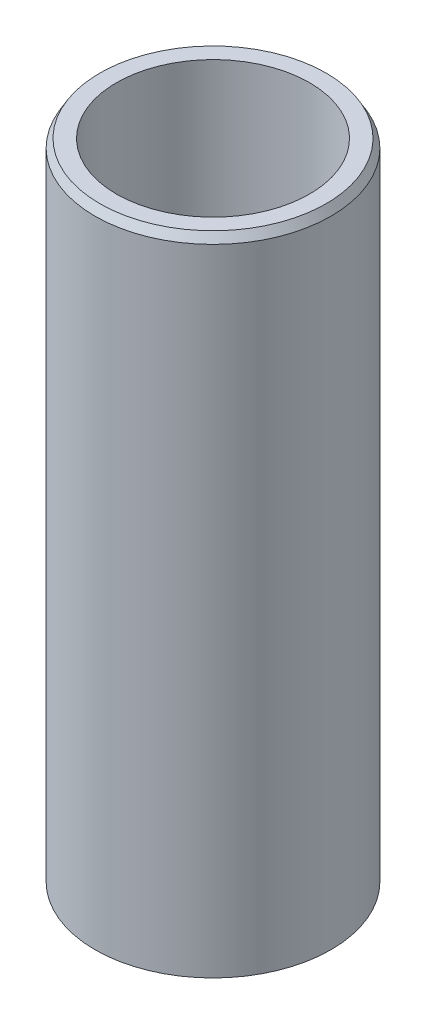
ISO-10303-21;
HEADER;
FILE_DESCRIPTION(('STEP AP214'),'2;1');
FILE_NAME('part.step','',(''),(''),'','','');
FILE_SCHEMA(('AUTOMOTIVE_DESIGN { 1 0 10303 214 1 1 1 1 }'));
ENDSEC;
DATA;
#1=APPLICATION_CONTEXT('core data for automotive mechanical design processes');
#2=APPLICATION_PROTOCOL_DEFINITION('international standard','automotive_design',2000,#1);
#3=PRODUCT_CONTEXT('',#1,'mechanical');
#4=PRODUCT('Part','Part','',(#3));
#5=PRODUCT_RELATED_PRODUCT_CATEGORY('part','',(#4));
#6=PRODUCT_DEFINITION_FORMATION('','',#4);
#7=PRODUCT_DEFINITION_CONTEXT('part definition',#1,'design');
#8=PRODUCT_DEFINITION('design','',#6,#7);
#9=PRODUCT_DEFINITION_SHAPE('','',#8);
#10=(LENGTH_UNIT() NAMED_UNIT(*) SI_UNIT(.MILLI.,.METRE.));
#11=(NAMED_UNIT(*) PLANE_ANGLE_UNIT() SI_UNIT($,.RADIAN.));
#12=(NAMED_UNIT(*) SI_UNIT($,.STERADIAN.) SOLID_ANGLE_UNIT());
#13=UNCERTAINTY_MEASURE_WITH_UNIT(LENGTH_MEASURE(1.E-05),#10,'distance_accuracy_value','');
#14=(GEOMETRIC_REPRESENTATION_CONTEXT(3) GLOBAL_UNCERTAINTY_ASSIGNED_CONTEXT((#13)) GLOBAL_UNIT_ASSIGNED_CONTEXT((#10,
#11,#12)) REPRESENTATION_CONTEXT('',''));
#15=CARTESIAN_POINT('',(0.,0.,0.));
#16=DIRECTION('',(0.,0.,1.));
#17=DIRECTION('',(1.,0.,0.));
#18=AXIS2_PLACEMENT_3D('',#15,#16,#17);
#19=CARTESIAN_POINT('',(0.,315.97672786074,0.));
#20=DIRECTION('',(0.,-1.,0.));
#21=DIRECTION('',(0.,0.,-1.));
#22=AXIS2_PLACEMENT_3D('',#19,#20,#21);
#23=CYLINDRICAL_SURFACE('',#22,57.5);
#24=CARTESIAN_POINT('',(0.,311.888082828276,0.));
#25=DIRECTION('',(0.,1.,0.));
#26=DIRECTION('',(0.,0.,1.));
#27=AXIS2_PLACEMENT_3D('',#24,#25,#26);
#28=CIRCLE('',#27,57.5);
#29=CARTESIAN_POINT('',(0.,311.888082828276,57.5));
#30=VERTEX_POINT('',#29);
#31=EDGE_CURVE('E50',#30,#30,#28,.F.);
#32=ORIENTED_EDGE('',*,*,#31,.T.);
#33=EDGE_LOOP('',(#32));
#34=FACE_BOUND('',#33,.T.);
#35=CARTESIAN_POINT('',(0.,2.36058031011371,0.));
#36=DIRECTION('',(0.,1.,0.));
#37=DIRECTION('',(0.,0.,1.));
#38=AXIS2_PLACEMENT_3D('',#35,#36,#37);
#39=CIRCLE('',#38,57.5);
#40=CARTESIAN_POINT('',(0.,2.36058031011371,57.5));
#41=VERTEX_POINT('',#40);
#42=EDGE_CURVE('E51',#41,#41,#39,.T.);
#43=ORIENTED_EDGE('',*,*,#42,.T.);
#44=EDGE_LOOP('',(#43));
#45=FACE_BOUND('',#44,.T.);
#46=ADVANCED_FACE('F39',(#34,#45),#23,.T.);
#47=CARTESIAN_POINT('',(0.,315.97672786074,0.));
#48=DIRECTION('',(0.,1.,0.));
#49=DIRECTION('',(0.,0.,1.));
#50=AXIS2_PLACEMENT_3D('',#47,#48,#49);
#51=PLANE('',#50);
#52=CARTESIAN_POINT('',(0.,315.97672786074,0.));
#53=DIRECTION('',(0.,1.,0.));
#54=DIRECTION('',(0.,0.,1.));
#55=AXIS2_PLACEMENT_3D('',#52,#53,#54);
#56=CIRCLE('',#55,55.1394196898863);
#57=CARTESIAN_POINT('',(0.,315.97672786074,55.1394196898863));
#58=VERTEX_POINT('',#57);
#59=EDGE_CURVE('E54',#58,#58,#56,.T.);
#60=ORIENTED_EDGE('',*,*,#59,.T.);
#61=EDGE_LOOP('',(#60));
#62=FACE_BOUND('',#61,.T.);
#63=CARTESIAN_POINT('',(0.,315.97672786074,0.));
#64=DIRECTION('',(0.,1.,0.));
#65=DIRECTION('',(0.,0.,1.));
#66=AXIS2_PLACEMENT_3D('',#63,#64,#65);
#67=CIRCLE('',#66,47.0345179157622);
#68=CARTESIAN_POINT('',(0.,315.97672786074,47.0345179157622));
#69=VERTEX_POINT('',#68);
#70=EDGE_CURVE('E58',#69,#69,#67,.T.);
#71=ORIENTED_EDGE('',*,*,#70,.F.);
#72=EDGE_LOOP('',(#71));
#73=FACE_BOUND('',#72,.T.);
#74=ADVANCED_FACE('F69',(#62,#73),#51,.T.);
#75=CARTESIAN_POINT('',(0.,0.,0.));
#76=DIRECTION('',(0.,1.,0.));
#77=DIRECTION('',(0.,0.,1.));
#78=AXIS2_PLACEMENT_3D('',#75,#76,#77);
#79=PLANE('',#78);
#80=CARTESIAN_POINT('',(0.,0.,0.));
#81=DIRECTION('',(0.,1.,0.));
#82=DIRECTION('',(0.,0.,1.));
#83=AXIS2_PLACEMENT_3D('',#80,#81,#82);
#84=CIRCLE('',#83,53.4113549675363);
#85=CARTESIAN_POINT('',(0.,0.,53.4113549675363));
#86=VERTEX_POINT('',#85);
#87=EDGE_CURVE('E10',#86,#86,#84,.F.);
#88=ORIENTED_EDGE('',*,*,#87,.T.);
#89=EDGE_LOOP('',(#88));
#90=FACE_BOUND('',#89,.T.);
#91=CARTESIAN_POINT('',(0.,0.,0.));
#92=DIRECTION('',(0.,1.,0.));
#93=DIRECTION('',(0.,0.,1.));
#94=AXIS2_PLACEMENT_3D('',#91,#92,#93);
#95=CIRCLE('',#94,47.0345179157622);
#96=CARTESIAN_POINT('',(0.,0.,47.0345179157622));
#97=VERTEX_POINT('',#96);
#98=EDGE_CURVE('E63',#97,#97,#95,.T.);
#99=ORIENTED_EDGE('',*,*,#98,.T.);
#100=EDGE_LOOP('',(#99));
#101=FACE_BOUND('',#100,.T.);
#102=ADVANCED_FACE('F75',(#90,#101),#79,.F.);
#103=CARTESIAN_POINT('',(0.,315.97672786074,0.));
#104=DIRECTION('',(0.,-1.,0.));
#105=DIRECTION('',(0.,0.,-1.));
#106=AXIS2_PLACEMENT_3D('',#103,#104,#105);
#107=CYLINDRICAL_SURFACE('',#106,47.0345179157622);
#108=ORIENTED_EDGE('',*,*,#70,.T.);
#109=EDGE_LOOP('',(#108));
#110=FACE_BOUND('',#109,.T.);
#111=ORIENTED_EDGE('',*,*,#98,.F.);
#112=EDGE_LOOP('',(#111));
#113=FACE_BOUND('',#112,.T.);
#114=ADVANCED_FACE('F70',(#110,#113),#107,.F.);
#115=CARTESIAN_POINT('',(0.,315.97672786074,0.));
#116=DIRECTION('',(0.,-1.,0.));
#117=DIRECTION('',(0.,0.,-1.));
#118=AXIS2_PLACEMENT_3D('',#115,#116,#117);
#119=CONICAL_SURFACE('',#118,55.1394196898863,0.523598775598296);
#120=ORIENTED_EDGE('',*,*,#31,.F.);
#121=EDGE_LOOP('',(#120));
#122=FACE_BOUND('',#121,.T.);
#123=ORIENTED_EDGE('',*,*,#59,.F.);
#124=EDGE_LOOP('',(#123));
#125=FACE_BOUND('',#124,.T.);
#126=ADVANCED_FACE('F81',(#122,#125),#119,.T.);
#127=CARTESIAN_POINT('',(0.,2.36058031011371,0.));
#128=DIRECTION('',(0.,1.,0.));
#129=DIRECTION('',(0.,0.,1.));
#130=AXIS2_PLACEMENT_3D('',#127,#128,#129);
#131=CONICAL_SURFACE('',#130,57.5,1.0471975511966);
#132=ORIENTED_EDGE('',*,*,#87,.F.);
#133=EDGE_LOOP('',(#132));
#134=FACE_BOUND('',#133,.T.);
#135=ORIENTED_EDGE('',*,*,#42,.F.);
#136=EDGE_LOOP('',(#135));
#137=FACE_BOUND('',#136,.T.);
#138=ADVANCED_FACE('F45',(#134,#137),#131,.T.);
#139=CLOSED_SHELL('',(#46,#74,#102,#114,#126,#138));
#140=MANIFOLD_SOLID_BREP('B2',#139);
#141=ADVANCED_BREP_SHAPE_REPRESENTATION('',(#18,#140),#14);
#142=SHAPE_DEFINITION_REPRESENTATION(#9,#141);
ENDSEC;
END-ISO-10303-21;
